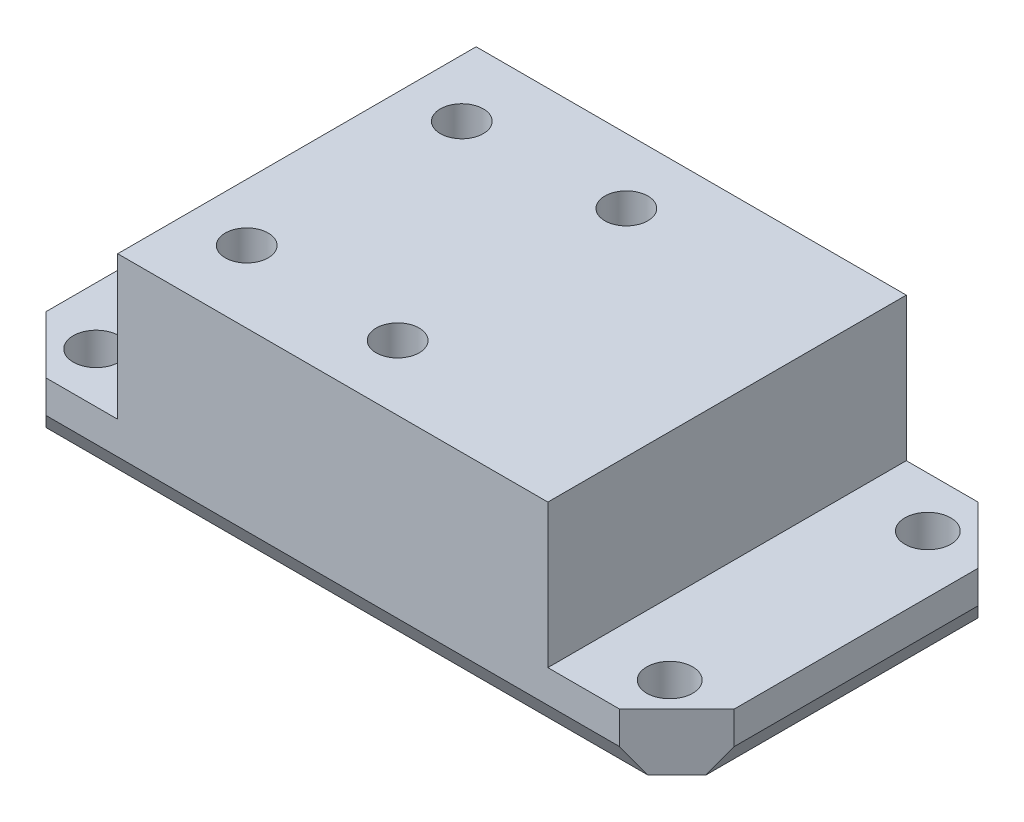
ISO-10303-21;
HEADER;
FILE_DESCRIPTION(('STEP AP214'),'2;1');
FILE_NAME('part.step','',(''),(''),'','','');
FILE_SCHEMA(('AUTOMOTIVE_DESIGN { 1 0 10303 214 1 1 1 1 }'));
ENDSEC;
DATA;
#1=APPLICATION_CONTEXT('core data for automotive mechanical design processes');
#2=APPLICATION_PROTOCOL_DEFINITION('international standard','automotive_design',2000,#1);
#3=PRODUCT_CONTEXT('',#1,'mechanical');
#4=PRODUCT('Part','Part','',(#3));
#5=PRODUCT_RELATED_PRODUCT_CATEGORY('part','',(#4));
#6=PRODUCT_DEFINITION_FORMATION('','',#4);
#7=PRODUCT_DEFINITION_CONTEXT('part definition',#1,'design');
#8=PRODUCT_DEFINITION('design','',#6,#7);
#9=PRODUCT_DEFINITION_SHAPE('','',#8);
#10=(LENGTH_UNIT() NAMED_UNIT(*) SI_UNIT(.MILLI.,.METRE.));
#11=(NAMED_UNIT(*) PLANE_ANGLE_UNIT() SI_UNIT($,.RADIAN.));
#12=(NAMED_UNIT(*) SI_UNIT($,.STERADIAN.) SOLID_ANGLE_UNIT());
#13=UNCERTAINTY_MEASURE_WITH_UNIT(LENGTH_MEASURE(1.E-05),#10,'distance_accuracy_value','');
#14=(GEOMETRIC_REPRESENTATION_CONTEXT(3) GLOBAL_UNCERTAINTY_ASSIGNED_CONTEXT((#13)) GLOBAL_UNIT_ASSIGNED_CONTEXT((#10,
#11,#12)) REPRESENTATION_CONTEXT('',''));
#15=CARTESIAN_POINT('',(0.,0.,0.));
#16=DIRECTION('',(0.,0.,1.));
#17=DIRECTION('',(1.,0.,0.));
#18=AXIS2_PLACEMENT_3D('',#15,#16,#17);
#19=CARTESIAN_POINT('',(0.,4.,0.));
#20=DIRECTION('',(0.,1.,0.));
#21=DIRECTION('',(0.,0.,1.));
#22=AXIS2_PLACEMENT_3D('',#19,#20,#21);
#23=PLANE('',#22);
#24=CARTESIAN_POINT('',(-20.,4.,-9.));
#25=DIRECTION('',(0.,1.,0.));
#26=DIRECTION('',(0.,0.,1.));
#27=AXIS2_PLACEMENT_3D('',#24,#25,#26);
#28=CIRCLE('',#27,1.6);
#29=CARTESIAN_POINT('',(-20.,4.,-7.4));
#30=VERTEX_POINT('',#29);
#31=EDGE_CURVE('E351',#30,#30,#28,.T.);
#32=ORIENTED_EDGE('',*,*,#31,.F.);
#33=EDGE_LOOP('',(#32));
#34=FACE_BOUND('',#33,.T.);
#35=CARTESIAN_POINT('',(-20.,4.,9.));
#36=DIRECTION('',(0.,1.,0.));
#37=DIRECTION('',(0.,0.,1.));
#38=AXIS2_PLACEMENT_3D('',#35,#36,#37);
#39=CIRCLE('',#38,1.6);
#40=CARTESIAN_POINT('',(-20.,4.,10.6));
#41=VERTEX_POINT('',#40);
#42=EDGE_CURVE('E362',#41,#41,#39,.T.);
#43=ORIENTED_EDGE('',*,*,#42,.F.);
#44=EDGE_LOOP('',(#43));
#45=FACE_BOUND('',#44,.T.);
#46=DIRECTION('',(-1.,0.,0.));
#47=VECTOR('',#46,1.);
#48=CARTESIAN_POINT('',(24.,4.,-12.5));
#49=LINE('',#48,#47);
#50=CARTESIAN_POINT('',(-15.,4.,-12.5));
#51=VERTEX_POINT('',#50);
#52=CARTESIAN_POINT('',(-20.,4.,-12.5));
#53=VERTEX_POINT('',#52);
#54=EDGE_CURVE('E188',#51,#53,#49,.T.);
#55=ORIENTED_EDGE('',*,*,#54,.T.);
#56=DIRECTION('',(0.707106781186548,0.,-0.707106781186547));
#57=VECTOR('',#56,1.);
#58=CARTESIAN_POINT('',(-16.25,4.,-16.25));
#59=LINE('',#58,#57);
#60=CARTESIAN_POINT('',(-24.,4.,-8.49999999999999));
#61=VERTEX_POINT('',#60);
#62=EDGE_CURVE('E11',#53,#61,#59,.F.);
#63=ORIENTED_EDGE('',*,*,#62,.T.);
#64=DIRECTION('',(0.,0.,1.));
#65=VECTOR('',#64,1.);
#66=CARTESIAN_POINT('',(-24.,4.,12.5));
#67=LINE('',#66,#65);
#68=CARTESIAN_POINT('',(-24.,4.,8.49999999999999));
#69=VERTEX_POINT('',#68);
#70=EDGE_CURVE('E175',#61,#69,#67,.T.);
#71=ORIENTED_EDGE('',*,*,#70,.T.);
#72=DIRECTION('',(-0.707106781186546,0.,-0.707106781186549));
#73=VECTOR('',#72,1.);
#74=CARTESIAN_POINT('',(-16.25,4.,16.25));
#75=LINE('',#74,#73);
#76=CARTESIAN_POINT('',(-20.,4.,12.5));
#77=VERTEX_POINT('',#76);
#78=EDGE_CURVE('E43',#69,#77,#75,.F.);
#79=ORIENTED_EDGE('',*,*,#78,.T.);
#80=DIRECTION('',(1.,0.,0.));
#81=VECTOR('',#80,1.);
#82=CARTESIAN_POINT('',(24.,4.,12.5));
#83=LINE('',#82,#81);
#84=CARTESIAN_POINT('',(-15.,4.,12.5));
#85=VERTEX_POINT('',#84);
#86=EDGE_CURVE('E183',#77,#85,#83,.T.);
#87=ORIENTED_EDGE('',*,*,#86,.T.);
#88=DIRECTION('',(0.,0.,1.));
#89=VECTOR('',#88,1.);
#90=CARTESIAN_POINT('',(-15.,4.,12.5));
#91=LINE('',#90,#89);
#92=EDGE_CURVE('E174',#51,#85,#91,.T.);
#93=ORIENTED_EDGE('',*,*,#92,.F.);
#94=EDGE_LOOP('',(#55,#63,#71,#79,#87,#93));
#95=FACE_BOUND('',#94,.T.);
#96=ADVANCED_FACE('F35',(#34,#45,#95),#23,.T.);
#97=CARTESIAN_POINT('',(-24.,4.,12.5));
#98=DIRECTION('',(1.,0.,0.));
#99=DIRECTION('',(0.,0.,-1.));
#100=AXIS2_PLACEMENT_3D('',#97,#98,#99);
#101=PLANE('',#100);
#102=ORIENTED_EDGE('',*,*,#70,.F.);
#103=DIRECTION('',(0.,-1.,0.));
#104=VECTOR('',#103,1.);
#105=CARTESIAN_POINT('',(-24.,4.,-8.49999999999999));
#106=LINE('',#105,#104);
#107=CARTESIAN_POINT('',(-24.,1.73205080756888,-8.49999999999999));
#108=VERTEX_POINT('',#107);
#109=EDGE_CURVE('E253',#61,#108,#106,.T.);
#110=ORIENTED_EDGE('',*,*,#109,.T.);
#111=DIRECTION('',(0.,0.,1.));
#112=VECTOR('',#111,1.);
#113=CARTESIAN_POINT('',(-24.,1.73205080756888,12.5));
#114=LINE('',#113,#112);
#115=CARTESIAN_POINT('',(-24.,1.73205080756888,8.49999999999999));
#116=VERTEX_POINT('',#115);
#117=EDGE_CURVE('E191',#108,#116,#114,.T.);
#118=ORIENTED_EDGE('',*,*,#117,.T.);
#119=DIRECTION('',(0.,1.,0.));
#120=VECTOR('',#119,1.);
#121=CARTESIAN_POINT('',(-24.,4.,8.49999999999999));
#122=LINE('',#121,#120);
#123=EDGE_CURVE('E50',#116,#69,#122,.T.);
#124=ORIENTED_EDGE('',*,*,#123,.T.);
#125=EDGE_LOOP('',(#102,#110,#118,#124));
#126=FACE_BOUND('',#125,.T.);
#127=ADVANCED_FACE('F314',(#126),#101,.F.);
#128=CARTESIAN_POINT('',(24.,4.,12.5));
#129=DIRECTION('',(0.,0.,-1.));
#130=DIRECTION('',(-1.,0.,0.));
#131=AXIS2_PLACEMENT_3D('',#128,#129,#130);
#132=PLANE('',#131);
#133=DIRECTION('',(1.,0.,0.));
#134=VECTOR('',#133,1.);
#135=CARTESIAN_POINT('',(24.,1.73205080756888,12.5));
#136=LINE('',#135,#134);
#137=CARTESIAN_POINT('',(-20.,1.73205080756888,12.5));
#138=VERTEX_POINT('',#137);
#139=CARTESIAN_POINT('',(20.,1.73205080756888,12.5));
#140=VERTEX_POINT('',#139);
#141=EDGE_CURVE('E211',#138,#140,#136,.T.);
#142=ORIENTED_EDGE('',*,*,#141,.T.);
#143=DIRECTION('',(0.,1.,0.));
#144=VECTOR('',#143,1.);
#145=CARTESIAN_POINT('',(20.,4.,12.5));
#146=LINE('',#145,#144);
#147=CARTESIAN_POINT('',(20.,4.,12.5));
#148=VERTEX_POINT('',#147);
#149=EDGE_CURVE('E250',#140,#148,#146,.T.);
#150=ORIENTED_EDGE('',*,*,#149,.T.);
#151=CARTESIAN_POINT('',(15.,4.,12.5));
#152=VERTEX_POINT('',#151);
#153=EDGE_CURVE('E177',#152,#148,#83,.T.);
#154=ORIENTED_EDGE('',*,*,#153,.F.);
#155=DIRECTION('',(0.,-1.,0.));
#156=VECTOR('',#155,1.);
#157=CARTESIAN_POINT('',(15.,14.,12.5));
#158=LINE('',#157,#156);
#159=CARTESIAN_POINT('',(15.,14.,12.5));
#160=VERTEX_POINT('',#159);
#161=EDGE_CURVE('E158',#160,#152,#158,.T.);
#162=ORIENTED_EDGE('',*,*,#161,.F.);
#163=DIRECTION('',(1.,0.,0.));
#164=VECTOR('',#163,1.);
#165=CARTESIAN_POINT('',(15.,14.,12.5));
#166=LINE('',#165,#164);
#167=CARTESIAN_POINT('',(-15.,14.,12.5));
#168=VERTEX_POINT('',#167);
#169=EDGE_CURVE('E148',#168,#160,#166,.T.);
#170=ORIENTED_EDGE('',*,*,#169,.F.);
#171=DIRECTION('',(0.,-1.,0.));
#172=VECTOR('',#171,1.);
#173=CARTESIAN_POINT('',(-15.,14.,12.5));
#174=LINE('',#173,#172);
#175=EDGE_CURVE('E154',#168,#85,#174,.T.);
#176=ORIENTED_EDGE('',*,*,#175,.T.);
#177=ORIENTED_EDGE('',*,*,#86,.F.);
#178=DIRECTION('',(0.,-1.,0.));
#179=VECTOR('',#178,1.);
#180=CARTESIAN_POINT('',(-20.,4.,12.5));
#181=LINE('',#180,#179);
#182=EDGE_CURVE('E247',#77,#138,#181,.T.);
#183=ORIENTED_EDGE('',*,*,#182,.T.);
#184=EDGE_LOOP('',(#142,#150,#154,#162,#170,#176,#177,#183));
#185=FACE_BOUND('',#184,.T.);
#186=ADVANCED_FACE('F151',(#185),#132,.F.);
#187=CARTESIAN_POINT('',(24.,4.,12.5));
#188=DIRECTION('',(-1.,0.,0.));
#189=DIRECTION('',(0.,0.,1.));
#190=AXIS2_PLACEMENT_3D('',#187,#188,#189);
#191=PLANE('',#190);
#192=DIRECTION('',(0.,0.,-1.));
#193=VECTOR('',#192,1.);
#194=CARTESIAN_POINT('',(24.,1.73205080756888,12.5));
#195=LINE('',#194,#193);
#196=CARTESIAN_POINT('',(24.,1.73205080756888,8.49999999999999));
#197=VERTEX_POINT('',#196);
#198=CARTESIAN_POINT('',(24.,1.73205080756888,-8.49999999999999));
#199=VERTEX_POINT('',#198);
#200=EDGE_CURVE('E208',#197,#199,#195,.T.);
#201=ORIENTED_EDGE('',*,*,#200,.T.);
#202=DIRECTION('',(0.,1.,0.));
#203=VECTOR('',#202,1.);
#204=CARTESIAN_POINT('',(24.,4.,-8.49999999999999));
#205=LINE('',#204,#203);
#206=CARTESIAN_POINT('',(24.,4.,-8.49999999999999));
#207=VERTEX_POINT('',#206);
#208=EDGE_CURVE('E237',#199,#207,#205,.T.);
#209=ORIENTED_EDGE('',*,*,#208,.T.);
#210=DIRECTION('',(0.,0.,-1.));
#211=VECTOR('',#210,1.);
#212=CARTESIAN_POINT('',(24.,4.,12.5));
#213=LINE('',#212,#211);
#214=CARTESIAN_POINT('',(24.,4.,8.49999999999999));
#215=VERTEX_POINT('',#214);
#216=EDGE_CURVE('E185',#215,#207,#213,.T.);
#217=ORIENTED_EDGE('',*,*,#216,.F.);
#218=DIRECTION('',(0.,-1.,0.));
#219=VECTOR('',#218,1.);
#220=CARTESIAN_POINT('',(24.,4.,8.49999999999999));
#221=LINE('',#220,#219);
#222=EDGE_CURVE('E234',#215,#197,#221,.T.);
#223=ORIENTED_EDGE('',*,*,#222,.T.);
#224=EDGE_LOOP('',(#201,#209,#217,#223));
#225=FACE_BOUND('',#224,.T.);
#226=ADVANCED_FACE('F287',(#225),#191,.F.);
#227=CARTESIAN_POINT('',(24.,4.,-12.5));
#228=DIRECTION('',(0.,0.,1.));
#229=DIRECTION('',(1.,0.,0.));
#230=AXIS2_PLACEMENT_3D('',#227,#228,#229);
#231=PLANE('',#230);
#232=CARTESIAN_POINT('',(20.,4.,-12.5));
#233=VERTEX_POINT('',#232);
#234=CARTESIAN_POINT('',(15.,4.,-12.5));
#235=VERTEX_POINT('',#234);
#236=EDGE_CURVE('E189',#233,#235,#49,.T.);
#237=ORIENTED_EDGE('',*,*,#236,.F.);
#238=DIRECTION('',(0.,-1.,0.));
#239=VECTOR('',#238,1.);
#240=CARTESIAN_POINT('',(20.,4.,-12.5));
#241=LINE('',#240,#239);
#242=CARTESIAN_POINT('',(20.,1.73205080756888,-12.5));
#243=VERTEX_POINT('',#242);
#244=EDGE_CURVE('E215',#233,#243,#241,.T.);
#245=ORIENTED_EDGE('',*,*,#244,.T.);
#246=DIRECTION('',(-1.,0.,0.));
#247=VECTOR('',#246,1.);
#248=CARTESIAN_POINT('',(24.,1.73205080756888,-12.5));
#249=LINE('',#248,#247);
#250=CARTESIAN_POINT('',(-20.,1.73205080756888,-12.5));
#251=VERTEX_POINT('',#250);
#252=EDGE_CURVE('E205',#243,#251,#249,.T.);
#253=ORIENTED_EDGE('',*,*,#252,.T.);
#254=DIRECTION('',(0.,1.,0.));
#255=VECTOR('',#254,1.);
#256=CARTESIAN_POINT('',(-20.,4.,-12.5));
#257=LINE('',#256,#255);
#258=EDGE_CURVE('E213',#251,#53,#257,.T.);
#259=ORIENTED_EDGE('',*,*,#258,.T.);
#260=ORIENTED_EDGE('',*,*,#54,.F.);
#261=DIRECTION('',(0.,-1.,0.));
#262=VECTOR('',#261,1.);
#263=CARTESIAN_POINT('',(-15.,14.,-12.5));
#264=LINE('',#263,#262);
#265=CARTESIAN_POINT('',(-15.,14.,-12.5));
#266=VERTEX_POINT('',#265);
#267=EDGE_CURVE('E391',#266,#51,#264,.T.);
#268=ORIENTED_EDGE('',*,*,#267,.F.);
#269=DIRECTION('',(-1.,0.,0.));
#270=VECTOR('',#269,1.);
#271=CARTESIAN_POINT('',(15.,14.,-12.5));
#272=LINE('',#271,#270);
#273=CARTESIAN_POINT('',(15.,14.,-12.5));
#274=VERTEX_POINT('',#273);
#275=EDGE_CURVE('E167',#274,#266,#272,.T.);
#276=ORIENTED_EDGE('',*,*,#275,.F.);
#277=DIRECTION('',(0.,-1.,0.));
#278=VECTOR('',#277,1.);
#279=CARTESIAN_POINT('',(15.,14.,-12.5));
#280=LINE('',#279,#278);
#281=EDGE_CURVE('E179',#274,#235,#280,.T.);
#282=ORIENTED_EDGE('',*,*,#281,.T.);
#283=EDGE_LOOP('',(#237,#245,#253,#259,#260,#268,#276,#282));
#284=FACE_BOUND('',#283,.T.);
#285=ADVANCED_FACE('F300',(#284),#231,.F.);
#286=CARTESIAN_POINT('',(20.,4.,9.));
#287=DIRECTION('',(0.,1.,0.));
#288=DIRECTION('',(0.,0.,1.));
#289=AXIS2_PLACEMENT_3D('',#286,#287,#288);
#290=CIRCLE('',#289,1.6);
#291=CARTESIAN_POINT('',(20.,4.,10.6));
#292=VERTEX_POINT('',#291);
#293=EDGE_CURVE('E346',#292,#292,#290,.T.);
#294=ORIENTED_EDGE('',*,*,#293,.F.);
#295=EDGE_LOOP('',(#294));
#296=FACE_BOUND('',#295,.T.);
#297=CARTESIAN_POINT('',(20.,4.,-9.));
#298=DIRECTION('',(0.,1.,0.));
#299=DIRECTION('',(0.,0.,1.));
#300=AXIS2_PLACEMENT_3D('',#297,#298,#299);
#301=CIRCLE('',#300,1.6);
#302=CARTESIAN_POINT('',(20.,4.,-7.4));
#303=VERTEX_POINT('',#302);
#304=EDGE_CURVE('E349',#303,#303,#301,.T.);
#305=ORIENTED_EDGE('',*,*,#304,.F.);
#306=EDGE_LOOP('',(#305));
#307=FACE_BOUND('',#306,.T.);
#308=ORIENTED_EDGE('',*,*,#216,.T.);
#309=DIRECTION('',(0.707106781186547,0.,0.707106781186548));
#310=VECTOR('',#309,1.);
#311=CARTESIAN_POINT('',(16.25,4.,-16.25));
#312=LINE('',#311,#310);
#313=EDGE_CURVE('E241',#207,#233,#312,.F.);
#314=ORIENTED_EDGE('',*,*,#313,.T.);
#315=ORIENTED_EDGE('',*,*,#236,.T.);
#316=DIRECTION('',(0.,0.,-1.));
#317=VECTOR('',#316,1.);
#318=CARTESIAN_POINT('',(15.,4.,12.5));
#319=LINE('',#318,#317);
#320=EDGE_CURVE('E171',#152,#235,#319,.T.);
#321=ORIENTED_EDGE('',*,*,#320,.F.);
#322=ORIENTED_EDGE('',*,*,#153,.T.);
#323=DIRECTION('',(-0.707106781186548,0.,0.707106781186547));
#324=VECTOR('',#323,1.);
#325=CARTESIAN_POINT('',(16.25,4.,16.25));
#326=LINE('',#325,#324);
#327=EDGE_CURVE('E239',#148,#215,#326,.F.);
#328=ORIENTED_EDGE('',*,*,#327,.T.);
#329=EDGE_LOOP('',(#308,#314,#315,#321,#322,#328));
#330=FACE_BOUND('',#329,.T.);
#331=ADVANCED_FACE('F282',(#296,#307,#330),#23,.T.);
#332=CARTESIAN_POINT('',(0.,0.,0.));
#333=DIRECTION('',(0.,1.,0.));
#334=DIRECTION('',(0.,0.,1.));
#335=AXIS2_PLACEMENT_3D('',#332,#333,#334);
#336=PLANE('',#335);
#337=DIRECTION('',(1.,0.,0.));
#338=VECTOR('',#337,1.);
#339=CARTESIAN_POINT('',(0.,0.,-11.5));
#340=LINE('',#339,#338);
#341=CARTESIAN_POINT('',(-21.,0.,-11.5));
#342=VERTEX_POINT('',#341);
#343=CARTESIAN_POINT('',(21.,0.,-11.5));
#344=VERTEX_POINT('',#343);
#345=EDGE_CURVE('E199',#342,#344,#340,.T.);
#346=ORIENTED_EDGE('',*,*,#345,.T.);
#347=DIRECTION('',(-0.707106781186547,0.,-0.707106781186548));
#348=VECTOR('',#347,1.);
#349=CARTESIAN_POINT('',(20.,0.,-12.5));
#350=LINE('',#349,#348);
#351=CARTESIAN_POINT('',(23.,0.,-9.49999999999999));
#352=VERTEX_POINT('',#351);
#353=EDGE_CURVE('E228',#344,#352,#350,.F.);
#354=ORIENTED_EDGE('',*,*,#353,.T.);
#355=DIRECTION('',(0.,0.,1.));
#356=VECTOR('',#355,1.);
#357=CARTESIAN_POINT('',(23.,0.,0.));
#358=LINE('',#357,#356);
#359=CARTESIAN_POINT('',(23.,0.,9.49999999999999));
#360=VERTEX_POINT('',#359);
#361=EDGE_CURVE('E196',#352,#360,#358,.T.);
#362=ORIENTED_EDGE('',*,*,#361,.T.);
#363=DIRECTION('',(0.707106781186548,0.,-0.707106781186547));
#364=VECTOR('',#363,1.);
#365=CARTESIAN_POINT('',(24.,0.,8.49999999999999));
#366=LINE('',#365,#364);
#367=CARTESIAN_POINT('',(21.,0.,11.5));
#368=VERTEX_POINT('',#367);
#369=EDGE_CURVE('E226',#360,#368,#366,.F.);
#370=ORIENTED_EDGE('',*,*,#369,.T.);
#371=DIRECTION('',(-1.,0.,0.));
#372=VECTOR('',#371,1.);
#373=CARTESIAN_POINT('',(0.,0.,11.5));
#374=LINE('',#373,#372);
#375=CARTESIAN_POINT('',(-21.,0.,11.5));
#376=VERTEX_POINT('',#375);
#377=EDGE_CURVE('E193',#368,#376,#374,.T.);
#378=ORIENTED_EDGE('',*,*,#377,.T.);
#379=DIRECTION('',(0.707106781186546,0.,0.707106781186549));
#380=VECTOR('',#379,1.);
#381=CARTESIAN_POINT('',(-20.,0.,12.5));
#382=LINE('',#381,#380);
#383=CARTESIAN_POINT('',(-23.,0.,9.5));
#384=VERTEX_POINT('',#383);
#385=EDGE_CURVE('E222',#376,#384,#382,.F.);
#386=ORIENTED_EDGE('',*,*,#385,.T.);
#387=DIRECTION('',(0.,0.,-1.));
#388=VECTOR('',#387,1.);
#389=CARTESIAN_POINT('',(-23.,0.,0.));
#390=LINE('',#389,#388);
#391=CARTESIAN_POINT('',(-23.,0.,-9.49999999999999));
#392=VERTEX_POINT('',#391);
#393=EDGE_CURVE('E202',#384,#392,#390,.T.);
#394=ORIENTED_EDGE('',*,*,#393,.T.);
#395=DIRECTION('',(-0.707106781186548,0.,0.707106781186547));
#396=VECTOR('',#395,1.);
#397=CARTESIAN_POINT('',(-24.,0.,-8.49999999999999));
#398=LINE('',#397,#396);
#399=EDGE_CURVE('E224',#392,#342,#398,.F.);
#400=ORIENTED_EDGE('',*,*,#399,.T.);
#401=EDGE_LOOP('',(#346,#354,#362,#370,#378,#386,#394,#400));
#402=FACE_BOUND('',#401,.T.);
#403=CARTESIAN_POINT('',(20.,0.,9.));
#404=DIRECTION('',(0.,-1.,0.));
#405=DIRECTION('',(0.,0.,-1.));
#406=AXIS2_PLACEMENT_3D('',#403,#404,#405);
#407=CIRCLE('',#406,1.6);
#408=CARTESIAN_POINT('',(20.,0.,7.4));
#409=VERTEX_POINT('',#408);
#410=EDGE_CURVE('E356',#409,#409,#407,.T.);
#411=ORIENTED_EDGE('',*,*,#410,.F.);
#412=EDGE_LOOP('',(#411));
#413=FACE_BOUND('',#412,.T.);
#414=CARTESIAN_POINT('',(20.,0.,-9.));
#415=DIRECTION('',(0.,-1.,0.));
#416=DIRECTION('',(0.,0.,-1.));
#417=AXIS2_PLACEMENT_3D('',#414,#415,#416);
#418=CIRCLE('',#417,1.6);
#419=CARTESIAN_POINT('',(20.,0.,-10.6));
#420=VERTEX_POINT('',#419);
#421=EDGE_CURVE('E442',#420,#420,#418,.T.);
#422=ORIENTED_EDGE('',*,*,#421,.F.);
#423=EDGE_LOOP('',(#422));
#424=FACE_BOUND('',#423,.T.);
#425=CARTESIAN_POINT('',(-20.,0.,-9.));
#426=DIRECTION('',(0.,-1.,0.));
#427=DIRECTION('',(0.,0.,-1.));
#428=AXIS2_PLACEMENT_3D('',#425,#426,#427);
#429=CIRCLE('',#428,1.6);
#430=CARTESIAN_POINT('',(-20.,0.,-10.6));
#431=VERTEX_POINT('',#430);
#432=EDGE_CURVE('E445',#431,#431,#429,.T.);
#433=ORIENTED_EDGE('',*,*,#432,.F.);
#434=EDGE_LOOP('',(#433));
#435=FACE_BOUND('',#434,.T.);
#436=CARTESIAN_POINT('',(-20.,0.,9.));
#437=DIRECTION('',(0.,-1.,0.));
#438=DIRECTION('',(0.,0.,-1.));
#439=AXIS2_PLACEMENT_3D('',#436,#437,#438);
#440=CIRCLE('',#439,1.6);
#441=CARTESIAN_POINT('',(-20.,0.,7.4));
#442=VERTEX_POINT('',#441);
#443=EDGE_CURVE('E353',#442,#442,#440,.T.);
#444=ORIENTED_EDGE('',*,*,#443,.F.);
#445=EDGE_LOOP('',(#444));
#446=FACE_BOUND('',#445,.T.);
#447=CARTESIAN_POINT('',(0.,0.,7.975));
#448=DIRECTION('',(0.,1.,0.));
#449=DIRECTION('',(0.,0.,1.));
#450=AXIS2_PLACEMENT_3D('',#447,#448,#449);
#451=CIRCLE('',#450,1.5);
#452=CARTESIAN_POINT('',(0.,0.,9.475));
#453=VERTEX_POINT('',#452);
#454=EDGE_CURVE('E366',#453,#453,#451,.T.);
#455=ORIENTED_EDGE('',*,*,#454,.T.);
#456=EDGE_LOOP('',(#455));
#457=FACE_BOUND('',#456,.T.);
#458=CARTESIAN_POINT('',(-11.,0.,-7.5));
#459=DIRECTION('',(0.,1.,0.));
#460=DIRECTION('',(0.,0.,1.));
#461=AXIS2_PLACEMENT_3D('',#458,#459,#460);
#462=CIRCLE('',#461,1.5);
#463=CARTESIAN_POINT('',(-11.,0.,-6.));
#464=VERTEX_POINT('',#463);
#465=EDGE_CURVE('E373',#464,#464,#462,.T.);
#466=ORIENTED_EDGE('',*,*,#465,.T.);
#467=EDGE_LOOP('',(#466));
#468=FACE_BOUND('',#467,.T.);
#469=CARTESIAN_POINT('',(-11.,0.,7.5));
#470=DIRECTION('',(0.,1.,0.));
#471=DIRECTION('',(0.,0.,1.));
#472=AXIS2_PLACEMENT_3D('',#469,#470,#471);
#473=CIRCLE('',#472,1.5);
#474=CARTESIAN_POINT('',(-11.,0.,9.));
#475=VERTEX_POINT('',#474);
#476=EDGE_CURVE('E379',#475,#475,#473,.T.);
#477=ORIENTED_EDGE('',*,*,#476,.T.);
#478=EDGE_LOOP('',(#477));
#479=FACE_BOUND('',#478,.T.);
#480=CARTESIAN_POINT('',(0.,0.,-7.975));
#481=DIRECTION('',(0.,1.,0.));
#482=DIRECTION('',(0.,0.,1.));
#483=AXIS2_PLACEMENT_3D('',#480,#481,#482);
#484=CIRCLE('',#483,1.5);
#485=CARTESIAN_POINT('',(0.,0.,-6.475));
#486=VERTEX_POINT('',#485);
#487=EDGE_CURVE('E384',#486,#486,#484,.T.);
#488=ORIENTED_EDGE('',*,*,#487,.T.);
#489=EDGE_LOOP('',(#488));
#490=FACE_BOUND('',#489,.T.);
#491=ADVANCED_FACE('F270',(#402,#413,#424,#435,#446,#457,#468,#479,#490),#336,.F.);
#492=CARTESIAN_POINT('',(-15.,14.,12.5));
#493=DIRECTION('',(1.,0.,0.));
#494=DIRECTION('',(0.,0.,-1.));
#495=AXIS2_PLACEMENT_3D('',#492,#493,#494);
#496=PLANE('',#495);
#497=ORIENTED_EDGE('',*,*,#92,.T.);
#498=ORIENTED_EDGE('',*,*,#175,.F.);
#499=DIRECTION('',(0.,0.,1.));
#500=VECTOR('',#499,1.);
#501=CARTESIAN_POINT('',(-15.,14.,12.5));
#502=LINE('',#501,#500);
#503=EDGE_CURVE('E162',#266,#168,#502,.T.);
#504=ORIENTED_EDGE('',*,*,#503,.F.);
#505=ORIENTED_EDGE('',*,*,#267,.T.);
#506=EDGE_LOOP('',(#497,#498,#504,#505));
#507=FACE_BOUND('',#506,.T.);
#508=ADVANCED_FACE('F173',(#507),#496,.F.);
#509=CARTESIAN_POINT('',(15.,14.,12.5));
#510=DIRECTION('',(-1.,0.,0.));
#511=DIRECTION('',(0.,0.,1.));
#512=AXIS2_PLACEMENT_3D('',#509,#510,#511);
#513=PLANE('',#512);
#514=ORIENTED_EDGE('',*,*,#320,.T.);
#515=ORIENTED_EDGE('',*,*,#281,.F.);
#516=DIRECTION('',(0.,0.,-1.));
#517=VECTOR('',#516,1.);
#518=CARTESIAN_POINT('',(15.,14.,12.5));
#519=LINE('',#518,#517);
#520=EDGE_CURVE('E161',#160,#274,#519,.T.);
#521=ORIENTED_EDGE('',*,*,#520,.F.);
#522=ORIENTED_EDGE('',*,*,#161,.T.);
#523=EDGE_LOOP('',(#514,#515,#521,#522));
#524=FACE_BOUND('',#523,.T.);
#525=ADVANCED_FACE('F395',(#524),#513,.F.);
#526=CARTESIAN_POINT('',(0.,14.,0.));
#527=DIRECTION('',(0.,1.,0.));
#528=DIRECTION('',(0.,0.,1.));
#529=AXIS2_PLACEMENT_3D('',#526,#527,#528);
#530=PLANE('',#529);
#531=CARTESIAN_POINT('',(0.,14.,7.975));
#532=DIRECTION('',(0.,1.,0.));
#533=DIRECTION('',(0.,0.,1.));
#534=AXIS2_PLACEMENT_3D('',#531,#532,#533);
#535=CIRCLE('',#534,1.5);
#536=CARTESIAN_POINT('',(0.,14.,9.475));
#537=VERTEX_POINT('',#536);
#538=EDGE_CURVE('E370',#537,#537,#535,.T.);
#539=ORIENTED_EDGE('',*,*,#538,.F.);
#540=EDGE_LOOP('',(#539));
#541=FACE_BOUND('',#540,.T.);
#542=CARTESIAN_POINT('',(-11.,14.,-7.5));
#543=DIRECTION('',(0.,1.,0.));
#544=DIRECTION('',(0.,0.,1.));
#545=AXIS2_PLACEMENT_3D('',#542,#543,#544);
#546=CIRCLE('',#545,1.5);
#547=CARTESIAN_POINT('',(-11.,14.,-6.));
#548=VERTEX_POINT('',#547);
#549=EDGE_CURVE('E376',#548,#548,#546,.T.);
#550=ORIENTED_EDGE('',*,*,#549,.F.);
#551=EDGE_LOOP('',(#550));
#552=FACE_BOUND('',#551,.T.);
#553=CARTESIAN_POINT('',(-11.,14.,7.5));
#554=DIRECTION('',(0.,1.,0.));
#555=DIRECTION('',(0.,0.,1.));
#556=AXIS2_PLACEMENT_3D('',#553,#554,#555);
#557=CIRCLE('',#556,1.5);
#558=CARTESIAN_POINT('',(-11.,14.,9.));
#559=VERTEX_POINT('',#558);
#560=EDGE_CURVE('E365',#559,#559,#557,.T.);
#561=ORIENTED_EDGE('',*,*,#560,.F.);
#562=EDGE_LOOP('',(#561));
#563=FACE_BOUND('',#562,.T.);
#564=CARTESIAN_POINT('',(0.,14.,-7.975));
#565=DIRECTION('',(0.,1.,0.));
#566=DIRECTION('',(0.,0.,1.));
#567=AXIS2_PLACEMENT_3D('',#564,#565,#566);
#568=CIRCLE('',#567,1.5);
#569=CARTESIAN_POINT('',(0.,14.,-6.475));
#570=VERTEX_POINT('',#569);
#571=EDGE_CURVE('E369',#570,#570,#568,.T.);
#572=ORIENTED_EDGE('',*,*,#571,.F.);
#573=EDGE_LOOP('',(#572));
#574=FACE_BOUND('',#573,.T.);
#575=ORIENTED_EDGE('',*,*,#503,.T.);
#576=ORIENTED_EDGE('',*,*,#169,.T.);
#577=ORIENTED_EDGE('',*,*,#520,.T.);
#578=ORIENTED_EDGE('',*,*,#275,.T.);
#579=EDGE_LOOP('',(#575,#576,#577,#578));
#580=FACE_BOUND('',#579,.T.);
#581=ADVANCED_FACE('F165',(#541,#552,#563,#574,#580),#530,.T.);
#582=CARTESIAN_POINT('',(0.,0.,-7.975));
#583=DIRECTION('',(0.,1.,0.));
#584=DIRECTION('',(0.,0.,1.));
#585=AXIS2_PLACEMENT_3D('',#582,#583,#584);
#586=CYLINDRICAL_SURFACE('',#585,1.5);
#587=ORIENTED_EDGE('',*,*,#487,.F.);
#588=EDGE_LOOP('',(#587));
#589=FACE_BOUND('',#588,.T.);
#590=ORIENTED_EDGE('',*,*,#571,.T.);
#591=EDGE_LOOP('',(#590));
#592=FACE_BOUND('',#591,.T.);
#593=ADVANCED_FACE('F402',(#589,#592),#586,.F.);
#594=CARTESIAN_POINT('',(-11.,0.,7.5));
#595=DIRECTION('',(0.,1.,0.));
#596=DIRECTION('',(0.,0.,1.));
#597=AXIS2_PLACEMENT_3D('',#594,#595,#596);
#598=CYLINDRICAL_SURFACE('',#597,1.5);
#599=ORIENTED_EDGE('',*,*,#476,.F.);
#600=EDGE_LOOP('',(#599));
#601=FACE_BOUND('',#600,.T.);
#602=ORIENTED_EDGE('',*,*,#560,.T.);
#603=EDGE_LOOP('',(#602));
#604=FACE_BOUND('',#603,.T.);
#605=ADVANCED_FACE('F408',(#601,#604),#598,.F.);
#606=CARTESIAN_POINT('',(-11.,0.,-7.5));
#607=DIRECTION('',(0.,1.,0.));
#608=DIRECTION('',(0.,0.,1.));
#609=AXIS2_PLACEMENT_3D('',#606,#607,#608);
#610=CYLINDRICAL_SURFACE('',#609,1.5);
#611=ORIENTED_EDGE('',*,*,#465,.F.);
#612=EDGE_LOOP('',(#611));
#613=FACE_BOUND('',#612,.T.);
#614=ORIENTED_EDGE('',*,*,#549,.T.);
#615=EDGE_LOOP('',(#614));
#616=FACE_BOUND('',#615,.T.);
#617=ADVANCED_FACE('F412',(#613,#616),#610,.F.);
#618=CARTESIAN_POINT('',(0.,0.,7.975));
#619=DIRECTION('',(0.,1.,0.));
#620=DIRECTION('',(0.,0.,1.));
#621=AXIS2_PLACEMENT_3D('',#618,#619,#620);
#622=CYLINDRICAL_SURFACE('',#621,1.5);
#623=ORIENTED_EDGE('',*,*,#454,.F.);
#624=EDGE_LOOP('',(#623));
#625=FACE_BOUND('',#624,.T.);
#626=ORIENTED_EDGE('',*,*,#538,.T.);
#627=EDGE_LOOP('',(#626));
#628=FACE_BOUND('',#627,.T.);
#629=ADVANCED_FACE('F416',(#625,#628),#622,.F.);
#630=CARTESIAN_POINT('',(-20.,14.,9.));
#631=DIRECTION('',(0.,-1.,0.));
#632=DIRECTION('',(0.,0.,-1.));
#633=AXIS2_PLACEMENT_3D('',#630,#631,#632);
#634=CYLINDRICAL_SURFACE('',#633,1.6);
#635=ORIENTED_EDGE('',*,*,#42,.T.);
#636=EDGE_LOOP('',(#635));
#637=FACE_BOUND('',#636,.T.);
#638=ORIENTED_EDGE('',*,*,#443,.T.);
#639=EDGE_LOOP('',(#638));
#640=FACE_BOUND('',#639,.T.);
#641=ADVANCED_FACE('F420',(#637,#640),#634,.F.);
#642=CARTESIAN_POINT('',(-20.,14.,-9.));
#643=DIRECTION('',(0.,-1.,0.));
#644=DIRECTION('',(0.,0.,-1.));
#645=AXIS2_PLACEMENT_3D('',#642,#643,#644);
#646=CYLINDRICAL_SURFACE('',#645,1.6);
#647=ORIENTED_EDGE('',*,*,#31,.T.);
#648=EDGE_LOOP('',(#647));
#649=FACE_BOUND('',#648,.T.);
#650=ORIENTED_EDGE('',*,*,#432,.T.);
#651=EDGE_LOOP('',(#650));
#652=FACE_BOUND('',#651,.T.);
#653=ADVANCED_FACE('F424',(#649,#652),#646,.F.);
#654=CARTESIAN_POINT('',(20.,14.,-9.));
#655=DIRECTION('',(0.,-1.,0.));
#656=DIRECTION('',(0.,0.,-1.));
#657=AXIS2_PLACEMENT_3D('',#654,#655,#656);
#658=CYLINDRICAL_SURFACE('',#657,1.6);
#659=ORIENTED_EDGE('',*,*,#304,.T.);
#660=EDGE_LOOP('',(#659));
#661=FACE_BOUND('',#660,.T.);
#662=ORIENTED_EDGE('',*,*,#421,.T.);
#663=EDGE_LOOP('',(#662));
#664=FACE_BOUND('',#663,.T.);
#665=ADVANCED_FACE('F428',(#661,#664),#658,.F.);
#666=CARTESIAN_POINT('',(20.,14.,9.));
#667=DIRECTION('',(0.,-1.,0.));
#668=DIRECTION('',(0.,0.,-1.));
#669=AXIS2_PLACEMENT_3D('',#666,#667,#668);
#670=CYLINDRICAL_SURFACE('',#669,1.6);
#671=ORIENTED_EDGE('',*,*,#293,.T.);
#672=EDGE_LOOP('',(#671));
#673=FACE_BOUND('',#672,.T.);
#674=ORIENTED_EDGE('',*,*,#410,.T.);
#675=EDGE_LOOP('',(#674));
#676=FACE_BOUND('',#675,.T.);
#677=ADVANCED_FACE('F432',(#673,#676),#670,.F.);
#678=CARTESIAN_POINT('',(24.,1.73205080756888,12.5));
#679=DIRECTION('',(-0.866025403784438,0.500000000000001,0.));
#680=DIRECTION('',(0.,0.,-1.));
#681=AXIS2_PLACEMENT_3D('',#678,#679,#680);
#682=PLANE('',#681);
#683=ORIENTED_EDGE('',*,*,#361,.F.);
#684=DIRECTION('',(0.447213595499959,0.774596669241482,0.44721359549996));
#685=VECTOR('',#684,1.);
#686=CARTESIAN_POINT('',(28.2,9.00666419935817,-4.29999999999996));
#687=LINE('',#686,#685);
#688=EDGE_CURVE('E232',#352,#199,#687,.T.);
#689=ORIENTED_EDGE('',*,*,#688,.T.);
#690=ORIENTED_EDGE('',*,*,#200,.F.);
#691=DIRECTION('',(-0.447213595499959,-0.774596669241483,0.447213595499958));
#692=VECTOR('',#691,1.);
#693=CARTESIAN_POINT('',(23.2,0.346410161513773,9.29999999999999));
#694=LINE('',#693,#692);
#695=EDGE_CURVE('E230',#197,#360,#694,.T.);
#696=ORIENTED_EDGE('',*,*,#695,.T.);
#697=EDGE_LOOP('',(#683,#689,#690,#696));
#698=FACE_BOUND('',#697,.T.);
#699=ADVANCED_FACE('F290',(#698),#682,.F.);
#700=CARTESIAN_POINT('',(24.,1.73205080756888,-12.5));
#701=DIRECTION('',(0.,0.500000000000002,0.866025403784438));
#702=DIRECTION('',(-1.,0.,0.));
#703=AXIS2_PLACEMENT_3D('',#700,#701,#702);
#704=PLANE('',#703);
#705=ORIENTED_EDGE('',*,*,#252,.F.);
#706=DIRECTION('',(0.447213595499958,-0.774596669241482,0.447213595499959));
#707=VECTOR('',#706,1.);
#708=CARTESIAN_POINT('',(20.8,0.346410161513774,-11.7));
#709=LINE('',#708,#707);
#710=EDGE_CURVE('E220',#243,#344,#709,.T.);
#711=ORIENTED_EDGE('',*,*,#710,.T.);
#712=ORIENTED_EDGE('',*,*,#345,.F.);
#713=DIRECTION('',(0.44721359549996,0.774596669241482,-0.447213595499959));
#714=VECTOR('',#713,1.);
#715=CARTESIAN_POINT('',(-11.1999999999999,16.974097914175,-21.3000000000001));
#716=LINE('',#715,#714);
#717=EDGE_CURVE('E218',#342,#251,#716,.T.);
#718=ORIENTED_EDGE('',*,*,#717,.T.);
#719=EDGE_LOOP('',(#705,#711,#712,#718));
#720=FACE_BOUND('',#719,.T.);
#721=ADVANCED_FACE('F305',(#720),#704,.F.);
#722=CARTESIAN_POINT('',(24.,1.73205080756888,12.5));
#723=DIRECTION('',(0.,0.500000000000001,-0.866025403784438));
#724=DIRECTION('',(1.,0.,0.));
#725=AXIS2_PLACEMENT_3D('',#722,#723,#724);
#726=PLANE('',#725);
#727=ORIENTED_EDGE('',*,*,#377,.F.);
#728=DIRECTION('',(-0.447213595499959,0.774596669241482,0.447213595499959));
#729=VECTOR('',#728,1.);
#730=CARTESIAN_POINT('',(20.8,0.346410161513768,11.7));
#731=LINE('',#730,#729);
#732=EDGE_CURVE('E245',#368,#140,#731,.T.);
#733=ORIENTED_EDGE('',*,*,#732,.T.);
#734=ORIENTED_EDGE('',*,*,#141,.F.);
#735=DIRECTION('',(-0.447213595499957,-0.774596669241483,-0.447213595499959));
#736=VECTOR('',#735,1.);
#737=CARTESIAN_POINT('',(-11.2,16.974097914175,21.3));
#738=LINE('',#737,#736);
#739=EDGE_CURVE('E243',#138,#376,#738,.T.);
#740=ORIENTED_EDGE('',*,*,#739,.T.);
#741=EDGE_LOOP('',(#727,#733,#734,#740));
#742=FACE_BOUND('',#741,.T.);
#743=ADVANCED_FACE('F267',(#742),#726,.F.);
#744=CARTESIAN_POINT('',(-24.,1.73205080756888,12.5));
#745=DIRECTION('',(0.866025403784438,0.500000000000001,0.));
#746=DIRECTION('',(0.,0.,1.));
#747=AXIS2_PLACEMENT_3D('',#744,#745,#746);
#748=PLANE('',#747);
#749=ORIENTED_EDGE('',*,*,#117,.F.);
#750=DIRECTION('',(0.447213595499959,-0.774596669241483,-0.447213595499958));
#751=VECTOR('',#750,1.);
#752=CARTESIAN_POINT('',(-28.2,9.00666419935816,-4.29999999999998));
#753=LINE('',#752,#751);
#754=EDGE_CURVE('E258',#108,#392,#753,.T.);
#755=ORIENTED_EDGE('',*,*,#754,.T.);
#756=ORIENTED_EDGE('',*,*,#393,.F.);
#757=DIRECTION('',(-0.447213595499959,0.774596669241482,-0.44721359549996));
#758=VECTOR('',#757,1.);
#759=CARTESIAN_POINT('',(-23.2,0.346410161513769,9.3));
#760=LINE('',#759,#758);
#761=EDGE_CURVE('E256',#384,#116,#760,.T.);
#762=ORIENTED_EDGE('',*,*,#761,.T.);
#763=EDGE_LOOP('',(#749,#755,#756,#762));
#764=FACE_BOUND('',#763,.T.);
#765=ADVANCED_FACE('F316',(#764),#748,.F.);
#766=CARTESIAN_POINT('',(20.,4.,-12.5));
#767=DIRECTION('',(-0.707106781186548,0.,0.707106781186547));
#768=DIRECTION('',(0.,-1.,0.));
#769=AXIS2_PLACEMENT_3D('',#766,#767,#768);
#770=PLANE('',#769);
#771=ORIENTED_EDGE('',*,*,#313,.F.);
#772=ORIENTED_EDGE('',*,*,#208,.F.);
#773=ORIENTED_EDGE('',*,*,#688,.F.);
#774=ORIENTED_EDGE('',*,*,#353,.F.);
#775=ORIENTED_EDGE('',*,*,#710,.F.);
#776=ORIENTED_EDGE('',*,*,#244,.F.);
#777=EDGE_LOOP('',(#771,#772,#773,#774,#775,#776));
#778=FACE_BOUND('',#777,.T.);
#779=ADVANCED_FACE('F295',(#778),#770,.F.);
#780=CARTESIAN_POINT('',(24.,4.,8.49999999999999));
#781=DIRECTION('',(-0.707106781186547,0.,-0.707106781186548));
#782=DIRECTION('',(0.,-1.,0.));
#783=AXIS2_PLACEMENT_3D('',#780,#781,#782);
#784=PLANE('',#783);
#785=ORIENTED_EDGE('',*,*,#327,.F.);
#786=ORIENTED_EDGE('',*,*,#149,.F.);
#787=ORIENTED_EDGE('',*,*,#732,.F.);
#788=ORIENTED_EDGE('',*,*,#369,.F.);
#789=ORIENTED_EDGE('',*,*,#695,.F.);
#790=ORIENTED_EDGE('',*,*,#222,.F.);
#791=EDGE_LOOP('',(#785,#786,#787,#788,#789,#790));
#792=FACE_BOUND('',#791,.T.);
#793=ADVANCED_FACE('F277',(#792),#784,.F.);
#794=CARTESIAN_POINT('',(-24.,4.,-8.49999999999999));
#795=DIRECTION('',(0.707106781186547,0.,0.707106781186548));
#796=DIRECTION('',(0.,-1.,0.));
#797=AXIS2_PLACEMENT_3D('',#794,#795,#796);
#798=PLANE('',#797);
#799=ORIENTED_EDGE('',*,*,#62,.F.);
#800=ORIENTED_EDGE('',*,*,#258,.F.);
#801=ORIENTED_EDGE('',*,*,#717,.F.);
#802=ORIENTED_EDGE('',*,*,#399,.F.);
#803=ORIENTED_EDGE('',*,*,#754,.F.);
#804=ORIENTED_EDGE('',*,*,#109,.F.);
#805=EDGE_LOOP('',(#799,#800,#801,#802,#803,#804));
#806=FACE_BOUND('',#805,.T.);
#807=ADVANCED_FACE('F309',(#806),#798,.F.);
#808=CARTESIAN_POINT('',(-20.,4.,12.5));
#809=DIRECTION('',(0.707106781186549,0.,-0.707106781186546));
#810=DIRECTION('',(0.,-1.,0.));
#811=AXIS2_PLACEMENT_3D('',#808,#809,#810);
#812=PLANE('',#811);
#813=ORIENTED_EDGE('',*,*,#78,.F.);
#814=ORIENTED_EDGE('',*,*,#123,.F.);
#815=ORIENTED_EDGE('',*,*,#761,.F.);
#816=ORIENTED_EDGE('',*,*,#385,.F.);
#817=ORIENTED_EDGE('',*,*,#739,.F.);
#818=ORIENTED_EDGE('',*,*,#182,.F.);
#819=EDGE_LOOP('',(#813,#814,#815,#816,#817,#818));
#820=FACE_BOUND('',#819,.T.);
#821=ADVANCED_FACE('F37',(#820),#812,.F.);
#822=CLOSED_SHELL('',(#96,#127,#186,#226,#285,#331,#491,#508,#525,#581,#593,#605,#617,#629,#641,
#653,#665,#677,#699,#721,#743,#765,#779,#793,#807,#821));
#823=MANIFOLD_SOLID_BREP('B2',#822);
#824=ADVANCED_BREP_SHAPE_REPRESENTATION('',(#18,#823),#14);
#825=SHAPE_DEFINITION_REPRESENTATION(#9,#824);
ENDSEC;
END-ISO-10303-21;
